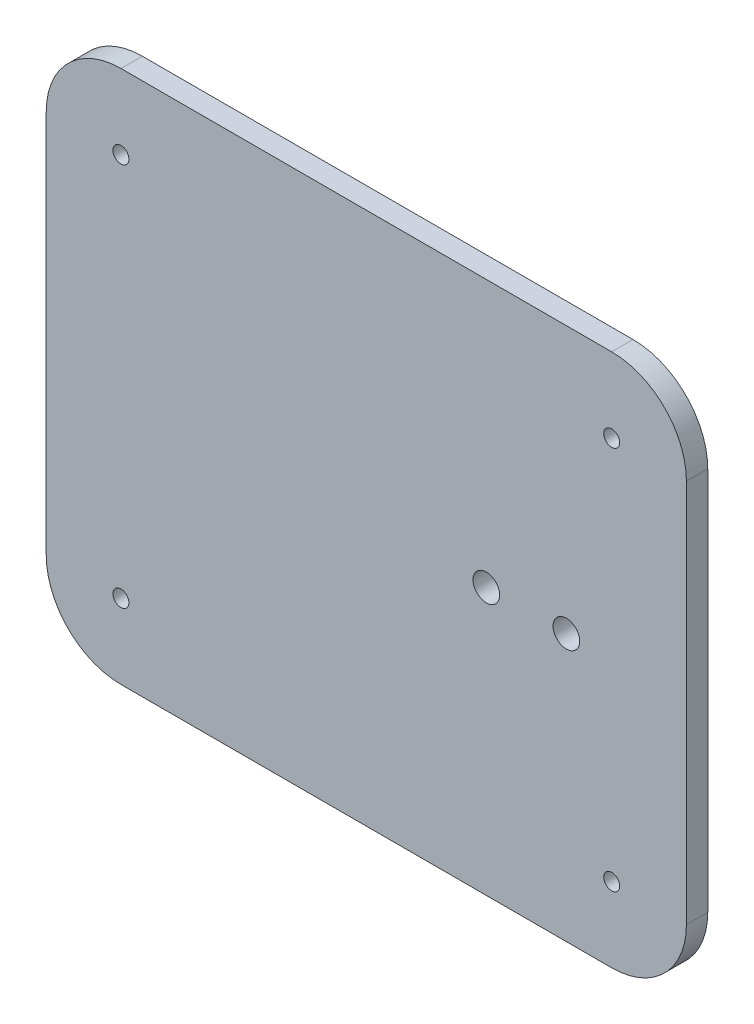
ISO-10303-21;
HEADER;
FILE_DESCRIPTION(('STEP AP214'),'2;1');
FILE_NAME('part.step','',(''),(''),'','','');
FILE_SCHEMA(('AUTOMOTIVE_DESIGN { 1 0 10303 214 1 1 1 1 }'));
ENDSEC;
DATA;
#1=APPLICATION_CONTEXT('core data for automotive mechanical design processes');
#2=APPLICATION_PROTOCOL_DEFINITION('international standard','automotive_design',2000,#1);
#3=PRODUCT_CONTEXT('',#1,'mechanical');
#4=PRODUCT('Part','Part','',(#3));
#5=PRODUCT_RELATED_PRODUCT_CATEGORY('part','',(#4));
#6=PRODUCT_DEFINITION_FORMATION('','',#4);
#7=PRODUCT_DEFINITION_CONTEXT('part definition',#1,'design');
#8=PRODUCT_DEFINITION('design','',#6,#7);
#9=PRODUCT_DEFINITION_SHAPE('','',#8);
#10=(LENGTH_UNIT() NAMED_UNIT(*) SI_UNIT(.MILLI.,.METRE.));
#11=(NAMED_UNIT(*) PLANE_ANGLE_UNIT() SI_UNIT($,.RADIAN.));
#12=(NAMED_UNIT(*) SI_UNIT($,.STERADIAN.) SOLID_ANGLE_UNIT());
#13=UNCERTAINTY_MEASURE_WITH_UNIT(LENGTH_MEASURE(1.E-05),#10,'distance_accuracy_value','');
#14=(GEOMETRIC_REPRESENTATION_CONTEXT(3) GLOBAL_UNCERTAINTY_ASSIGNED_CONTEXT((#13)) GLOBAL_UNIT_ASSIGNED_CONTEXT((#10,
#11,#12)) REPRESENTATION_CONTEXT('',''));
#15=CARTESIAN_POINT('',(0.,0.,0.));
#16=DIRECTION('',(0.,0.,1.));
#17=DIRECTION('',(1.,0.,0.));
#18=AXIS2_PLACEMENT_3D('',#15,#16,#17);
#19=CARTESIAN_POINT('',(-52.655601659751,38.8381742738589,4.));
#20=DIRECTION('',(1.,0.,0.));
#21=DIRECTION('',(0.,1.,0.));
#22=AXIS2_PLACEMENT_3D('',#19,#20,#21);
#23=PLANE('',#22);
#24=DIRECTION('',(0.,-1.,0.));
#25=VECTOR('',#24,1.);
#26=CARTESIAN_POINT('',(-52.655601659751,38.8381742738589,0.));
#27=LINE('',#26,#25);
#28=CARTESIAN_POINT('',(-52.655601659751,24.8381742738589,0.));
#29=VERTEX_POINT('',#28);
#30=CARTESIAN_POINT('',(-52.655601659751,-47.1618257261411,0.));
#31=VERTEX_POINT('',#30);
#32=EDGE_CURVE('E185',#29,#31,#27,.T.);
#33=ORIENTED_EDGE('',*,*,#32,.T.);
#34=DIRECTION('',(0.,0.,-1.));
#35=VECTOR('',#34,1.);
#36=CARTESIAN_POINT('',(-52.655601659751,-47.1618257261411,4.));
#37=LINE('',#36,#35);
#38=CARTESIAN_POINT('',(-52.655601659751,-47.1618257261411,4.));
#39=VERTEX_POINT('',#38);
#40=EDGE_CURVE('E11',#31,#39,#37,.F.);
#41=ORIENTED_EDGE('',*,*,#40,.T.);
#42=DIRECTION('',(0.,-1.,0.));
#43=VECTOR('',#42,1.);
#44=CARTESIAN_POINT('',(-52.655601659751,38.8381742738589,4.));
#45=LINE('',#44,#43);
#46=CARTESIAN_POINT('',(-52.655601659751,24.8381742738589,4.));
#47=VERTEX_POINT('',#46);
#48=EDGE_CURVE('E138',#47,#39,#45,.T.);
#49=ORIENTED_EDGE('',*,*,#48,.F.);
#50=DIRECTION('',(0.,0.,-1.));
#51=VECTOR('',#50,1.);
#52=CARTESIAN_POINT('',(-52.655601659751,24.8381742738589,4.));
#53=LINE('',#52,#51);
#54=EDGE_CURVE('E51',#47,#29,#53,.T.);
#55=ORIENTED_EDGE('',*,*,#54,.T.);
#56=EDGE_LOOP('',(#33,#41,#49,#55));
#57=FACE_BOUND('',#56,.T.);
#58=ADVANCED_FACE('F42',(#57),#23,.F.);
#59=CARTESIAN_POINT('',(-52.655601659751,-61.1618257261411,4.));
#60=DIRECTION('',(0.,1.,0.));
#61=DIRECTION('',(0.,0.,1.));
#62=AXIS2_PLACEMENT_3D('',#59,#60,#61);
#63=PLANE('',#62);
#64=DIRECTION('',(1.,0.,0.));
#65=VECTOR('',#64,1.);
#66=CARTESIAN_POINT('',(-52.655601659751,-61.1618257261411,0.));
#67=LINE('',#66,#65);
#68=CARTESIAN_POINT('',(-38.655601659751,-61.1618257261411,0.));
#69=VERTEX_POINT('',#68);
#70=CARTESIAN_POINT('',(53.3443983402489,-61.1618257261411,0.));
#71=VERTEX_POINT('',#70);
#72=EDGE_CURVE('E145',#69,#71,#67,.T.);
#73=ORIENTED_EDGE('',*,*,#72,.T.);
#74=DIRECTION('',(0.,0.,-1.));
#75=VECTOR('',#74,1.);
#76=CARTESIAN_POINT('',(53.344398340249,-61.1618257261411,4.));
#77=LINE('',#76,#75);
#78=CARTESIAN_POINT('',(53.3443983402489,-61.1618257261411,4.));
#79=VERTEX_POINT('',#78);
#80=EDGE_CURVE('E58',#71,#79,#77,.F.);
#81=ORIENTED_EDGE('',*,*,#80,.T.);
#82=DIRECTION('',(1.,0.,0.));
#83=VECTOR('',#82,1.);
#84=CARTESIAN_POINT('',(-52.655601659751,-61.1618257261411,4.));
#85=LINE('',#84,#83);
#86=CARTESIAN_POINT('',(-38.655601659751,-61.1618257261411,4.));
#87=VERTEX_POINT('',#86);
#88=EDGE_CURVE('E143',#87,#79,#85,.T.);
#89=ORIENTED_EDGE('',*,*,#88,.F.);
#90=DIRECTION('',(0.,0.,-1.));
#91=VECTOR('',#90,1.);
#92=CARTESIAN_POINT('',(-38.655601659751,-61.1618257261411,4.));
#93=LINE('',#92,#91);
#94=EDGE_CURVE('E174',#87,#69,#93,.T.);
#95=ORIENTED_EDGE('',*,*,#94,.T.);
#96=EDGE_LOOP('',(#73,#81,#89,#95));
#97=FACE_BOUND('',#96,.T.);
#98=ADVANCED_FACE('F290',(#97),#63,.F.);
#99=CARTESIAN_POINT('',(67.344398340249,38.8381742738589,4.));
#100=DIRECTION('',(-1.,0.,0.));
#101=DIRECTION('',(0.,0.,1.));
#102=AXIS2_PLACEMENT_3D('',#99,#100,#101);
#103=PLANE('',#102);
#104=DIRECTION('',(0.,1.,0.));
#105=VECTOR('',#104,1.);
#106=CARTESIAN_POINT('',(67.344398340249,38.8381742738589,0.));
#107=LINE('',#106,#105);
#108=CARTESIAN_POINT('',(67.344398340249,-47.1618257261411,0.));
#109=VERTEX_POINT('',#108);
#110=CARTESIAN_POINT('',(67.344398340249,24.8381742738589,0.));
#111=VERTEX_POINT('',#110);
#112=EDGE_CURVE('E139',#109,#111,#107,.T.);
#113=ORIENTED_EDGE('',*,*,#112,.T.);
#114=DIRECTION('',(0.,0.,-1.));
#115=VECTOR('',#114,1.);
#116=CARTESIAN_POINT('',(67.344398340249,24.8381742738589,4.));
#117=LINE('',#116,#115);
#118=CARTESIAN_POINT('',(67.344398340249,24.8381742738589,4.));
#119=VERTEX_POINT('',#118);
#120=EDGE_CURVE('E114',#111,#119,#117,.F.);
#121=ORIENTED_EDGE('',*,*,#120,.T.);
#122=DIRECTION('',(0.,1.,0.));
#123=VECTOR('',#122,1.);
#124=CARTESIAN_POINT('',(67.344398340249,38.8381742738589,4.));
#125=LINE('',#124,#123);
#126=CARTESIAN_POINT('',(67.344398340249,-47.1618257261411,4.));
#127=VERTEX_POINT('',#126);
#128=EDGE_CURVE('E201',#127,#119,#125,.T.);
#129=ORIENTED_EDGE('',*,*,#128,.F.);
#130=DIRECTION('',(0.,0.,-1.));
#131=VECTOR('',#130,1.);
#132=CARTESIAN_POINT('',(67.344398340249,-47.1618257261411,4.));
#133=LINE('',#132,#131);
#134=EDGE_CURVE('E120',#127,#109,#133,.T.);
#135=ORIENTED_EDGE('',*,*,#134,.T.);
#136=EDGE_LOOP('',(#113,#121,#129,#135));
#137=FACE_BOUND('',#136,.T.);
#138=ADVANCED_FACE('F287',(#137),#103,.F.);
#139=CARTESIAN_POINT('',(-52.655601659751,38.8381742738589,4.));
#140=DIRECTION('',(0.,-1.,0.));
#141=DIRECTION('',(0.,0.,-1.));
#142=AXIS2_PLACEMENT_3D('',#139,#140,#141);
#143=PLANE('',#142);
#144=DIRECTION('',(-1.,0.,0.));
#145=VECTOR('',#144,1.);
#146=CARTESIAN_POINT('',(-52.655601659751,38.8381742738589,4.));
#147=LINE('',#146,#145);
#148=CARTESIAN_POINT('',(53.344398340249,38.8381742738589,4.));
#149=VERTEX_POINT('',#148);
#150=CARTESIAN_POINT('',(-38.655601659751,38.8381742738589,4.));
#151=VERTEX_POINT('',#150);
#152=EDGE_CURVE('E130',#149,#151,#147,.T.);
#153=ORIENTED_EDGE('',*,*,#152,.F.);
#154=DIRECTION('',(0.,0.,-1.));
#155=VECTOR('',#154,1.);
#156=CARTESIAN_POINT('',(53.344398340249,38.8381742738589,4.));
#157=LINE('',#156,#155);
#158=CARTESIAN_POINT('',(53.344398340249,38.8381742738589,0.));
#159=VERTEX_POINT('',#158);
#160=EDGE_CURVE('E113',#149,#159,#157,.T.);
#161=ORIENTED_EDGE('',*,*,#160,.T.);
#162=DIRECTION('',(-1.,0.,0.));
#163=VECTOR('',#162,1.);
#164=CARTESIAN_POINT('',(-52.655601659751,38.8381742738589,0.));
#165=LINE('',#164,#163);
#166=CARTESIAN_POINT('',(-38.655601659751,38.8381742738589,0.));
#167=VERTEX_POINT('',#166);
#168=EDGE_CURVE('E127',#159,#167,#165,.T.);
#169=ORIENTED_EDGE('',*,*,#168,.T.);
#170=DIRECTION('',(0.,0.,-1.));
#171=VECTOR('',#170,1.);
#172=CARTESIAN_POINT('',(-38.655601659751,38.8381742738589,4.));
#173=LINE('',#172,#171);
#174=EDGE_CURVE('E133',#167,#151,#173,.F.);
#175=ORIENTED_EDGE('',*,*,#174,.T.);
#176=EDGE_LOOP('',(#153,#161,#169,#175));
#177=FACE_BOUND('',#176,.T.);
#178=ADVANCED_FACE('F126',(#177),#143,.F.);
#179=CARTESIAN_POINT('',(0.,0.,4.));
#180=DIRECTION('',(0.,0.,1.));
#181=DIRECTION('',(1.,0.,0.));
#182=AXIS2_PLACEMENT_3D('',#179,#180,#181);
#183=PLANE('',#182);
#184=CARTESIAN_POINT('',(44.844398340249,-11.1618257261411,4.));
#185=DIRECTION('',(0.,0.,-1.));
#186=DIRECTION('',(-1.,0.,0.));
#187=AXIS2_PLACEMENT_3D('',#184,#185,#186);
#188=CIRCLE('',#187,2.5);
#189=CARTESIAN_POINT('',(42.344398340249,-11.1618257261411,4.));
#190=VERTEX_POINT('',#189);
#191=EDGE_CURVE('E216',#190,#190,#188,.T.);
#192=ORIENTED_EDGE('',*,*,#191,.T.);
#193=EDGE_LOOP('',(#192));
#194=FACE_BOUND('',#193,.T.);
#195=CARTESIAN_POINT('',(29.844398340249,-11.1618257261411,4.));
#196=DIRECTION('',(0.,0.,-1.));
#197=DIRECTION('',(-1.,0.,0.));
#198=AXIS2_PLACEMENT_3D('',#195,#196,#197);
#199=CIRCLE('',#198,2.5);
#200=CARTESIAN_POINT('',(27.344398340249,-11.1618257261411,4.));
#201=VERTEX_POINT('',#200);
#202=EDGE_CURVE('E235',#201,#201,#199,.T.);
#203=ORIENTED_EDGE('',*,*,#202,.T.);
#204=EDGE_LOOP('',(#203));
#205=FACE_BOUND('',#204,.T.);
#206=CARTESIAN_POINT('',(53.3443983402491,-47.1618257261411,4.));
#207=DIRECTION('',(0.,0.,1.));
#208=DIRECTION('',(1.,0.,0.));
#209=AXIS2_PLACEMENT_3D('',#206,#207,#208);
#210=CIRCLE('',#209,1.5);
#211=CARTESIAN_POINT('',(54.8443983402491,-47.1618257261411,4.));
#212=VERTEX_POINT('',#211);
#213=EDGE_CURVE('E215',#212,#212,#210,.T.);
#214=ORIENTED_EDGE('',*,*,#213,.F.);
#215=EDGE_LOOP('',(#214));
#216=FACE_BOUND('',#215,.T.);
#217=CARTESIAN_POINT('',(-38.6556016597509,-47.1618257261411,4.));
#218=DIRECTION('',(0.,0.,1.));
#219=DIRECTION('',(1.,0.,0.));
#220=AXIS2_PLACEMENT_3D('',#217,#218,#219);
#221=CIRCLE('',#220,1.5);
#222=CARTESIAN_POINT('',(-37.1556016597509,-47.1618257261411,4.));
#223=VERTEX_POINT('',#222);
#224=EDGE_CURVE('E224',#223,#223,#221,.T.);
#225=ORIENTED_EDGE('',*,*,#224,.F.);
#226=EDGE_LOOP('',(#225));
#227=FACE_BOUND('',#226,.T.);
#228=CARTESIAN_POINT('',(-38.655601659751,24.8381742738589,4.));
#229=DIRECTION('',(0.,0.,1.));
#230=DIRECTION('',(1.,0.,0.));
#231=AXIS2_PLACEMENT_3D('',#228,#229,#230);
#232=CIRCLE('',#231,1.5);
#233=CARTESIAN_POINT('',(-37.155601659751,24.8381742738589,4.));
#234=VERTEX_POINT('',#233);
#235=EDGE_CURVE('E209',#234,#234,#232,.T.);
#236=ORIENTED_EDGE('',*,*,#235,.F.);
#237=EDGE_LOOP('',(#236));
#238=FACE_BOUND('',#237,.T.);
#239=CARTESIAN_POINT('',(53.3443983402489,24.8381742738589,4.));
#240=DIRECTION('',(0.,0.,1.));
#241=DIRECTION('',(1.,0.,0.));
#242=AXIS2_PLACEMENT_3D('',#239,#240,#241);
#243=CIRCLE('',#242,1.5);
#244=CARTESIAN_POINT('',(54.8443983402489,24.8381742738589,4.));
#245=VERTEX_POINT('',#244);
#246=EDGE_CURVE('E196',#245,#245,#243,.T.);
#247=ORIENTED_EDGE('',*,*,#246,.F.);
#248=EDGE_LOOP('',(#247));
#249=FACE_BOUND('',#248,.T.);
#250=ORIENTED_EDGE('',*,*,#128,.T.);
#251=CARTESIAN_POINT('',(53.344398340249,24.8381742738589,4.));
#252=DIRECTION('',(0.,0.,1.));
#253=DIRECTION('',(1.,0.,0.));
#254=AXIS2_PLACEMENT_3D('',#251,#252,#253);
#255=CIRCLE('',#254,14.);
#256=EDGE_CURVE('E171',#119,#149,#255,.T.);
#257=ORIENTED_EDGE('',*,*,#256,.T.);
#258=ORIENTED_EDGE('',*,*,#152,.T.);
#259=CARTESIAN_POINT('',(-38.655601659751,24.8381742738589,4.));
#260=DIRECTION('',(0.,0.,1.));
#261=DIRECTION('',(1.,0.,0.));
#262=AXIS2_PLACEMENT_3D('',#259,#260,#261);
#263=CIRCLE('',#262,14.);
#264=EDGE_CURVE('E163',#151,#47,#263,.T.);
#265=ORIENTED_EDGE('',*,*,#264,.T.);
#266=ORIENTED_EDGE('',*,*,#48,.T.);
#267=CARTESIAN_POINT('',(-38.655601659751,-47.1618257261411,4.));
#268=DIRECTION('',(0.,0.,1.));
#269=DIRECTION('',(1.,0.,0.));
#270=AXIS2_PLACEMENT_3D('',#267,#268,#269);
#271=CIRCLE('',#270,14.);
#272=EDGE_CURVE('E65',#39,#87,#271,.T.);
#273=ORIENTED_EDGE('',*,*,#272,.T.);
#274=ORIENTED_EDGE('',*,*,#88,.T.);
#275=CARTESIAN_POINT('',(53.344398340249,-47.1618257261411,4.));
#276=DIRECTION('',(0.,0.,1.));
#277=DIRECTION('',(1.,0.,0.));
#278=AXIS2_PLACEMENT_3D('',#275,#276,#277);
#279=CIRCLE('',#278,14.);
#280=EDGE_CURVE('E168',#79,#127,#279,.T.);
#281=ORIENTED_EDGE('',*,*,#280,.T.);
#282=EDGE_LOOP('',(#250,#257,#258,#265,#266,#273,#274,#281));
#283=FACE_BOUND('',#282,.T.);
#284=ADVANCED_FACE('F251',(#194,#205,#216,#227,#238,#249,#283),#183,.T.);
#285=CARTESIAN_POINT('',(0.,0.,0.));
#286=DIRECTION('',(0.,0.,1.));
#287=DIRECTION('',(1.,0.,0.));
#288=AXIS2_PLACEMENT_3D('',#285,#286,#287);
#289=PLANE('',#288);
#290=CARTESIAN_POINT('',(44.844398340249,-11.1618257261411,0.));
#291=DIRECTION('',(0.,0.,-1.));
#292=DIRECTION('',(-1.,0.,0.));
#293=AXIS2_PLACEMENT_3D('',#290,#291,#292);
#294=CIRCLE('',#293,2.5);
#295=CARTESIAN_POINT('',(42.344398340249,-11.1618257261411,0.));
#296=VERTEX_POINT('',#295);
#297=EDGE_CURVE('E243',#296,#296,#294,.T.);
#298=ORIENTED_EDGE('',*,*,#297,.F.);
#299=EDGE_LOOP('',(#298));
#300=FACE_BOUND('',#299,.T.);
#301=CARTESIAN_POINT('',(29.844398340249,-11.1618257261411,0.));
#302=DIRECTION('',(0.,0.,-1.));
#303=DIRECTION('',(-1.,0.,0.));
#304=AXIS2_PLACEMENT_3D('',#301,#302,#303);
#305=CIRCLE('',#304,2.5);
#306=CARTESIAN_POINT('',(27.344398340249,-11.1618257261411,0.));
#307=VERTEX_POINT('',#306);
#308=EDGE_CURVE('E239',#307,#307,#305,.T.);
#309=ORIENTED_EDGE('',*,*,#308,.F.);
#310=EDGE_LOOP('',(#309));
#311=FACE_BOUND('',#310,.T.);
#312=CARTESIAN_POINT('',(53.3443983402491,-47.1618257261411,0.));
#313=DIRECTION('',(0.,0.,1.));
#314=DIRECTION('',(1.,0.,0.));
#315=AXIS2_PLACEMENT_3D('',#312,#313,#314);
#316=CIRCLE('',#315,1.5);
#317=CARTESIAN_POINT('',(54.8443983402491,-47.1618257261411,0.));
#318=VERTEX_POINT('',#317);
#319=EDGE_CURVE('E211',#318,#318,#316,.T.);
#320=ORIENTED_EDGE('',*,*,#319,.T.);
#321=EDGE_LOOP('',(#320));
#322=FACE_BOUND('',#321,.T.);
#323=CARTESIAN_POINT('',(-38.6556016597509,-47.1618257261411,0.));
#324=DIRECTION('',(0.,0.,1.));
#325=DIRECTION('',(1.,0.,0.));
#326=AXIS2_PLACEMENT_3D('',#323,#324,#325);
#327=CIRCLE('',#326,1.5);
#328=CARTESIAN_POINT('',(-37.1556016597509,-47.1618257261411,0.));
#329=VERTEX_POINT('',#328);
#330=EDGE_CURVE('E220',#329,#329,#327,.T.);
#331=ORIENTED_EDGE('',*,*,#330,.T.);
#332=EDGE_LOOP('',(#331));
#333=FACE_BOUND('',#332,.T.);
#334=CARTESIAN_POINT('',(-38.655601659751,24.8381742738589,0.));
#335=DIRECTION('',(0.,0.,1.));
#336=DIRECTION('',(1.,0.,0.));
#337=AXIS2_PLACEMENT_3D('',#334,#335,#336);
#338=CIRCLE('',#337,1.5);
#339=CARTESIAN_POINT('',(-37.155601659751,24.8381742738589,0.));
#340=VERTEX_POINT('',#339);
#341=EDGE_CURVE('E228',#340,#340,#338,.T.);
#342=ORIENTED_EDGE('',*,*,#341,.T.);
#343=EDGE_LOOP('',(#342));
#344=FACE_BOUND('',#343,.T.);
#345=CARTESIAN_POINT('',(53.3443983402489,24.8381742738589,0.));
#346=DIRECTION('',(0.,0.,1.));
#347=DIRECTION('',(1.,0.,0.));
#348=AXIS2_PLACEMENT_3D('',#345,#346,#347);
#349=CIRCLE('',#348,1.5);
#350=CARTESIAN_POINT('',(54.8443983402489,24.8381742738589,0.));
#351=VERTEX_POINT('',#350);
#352=EDGE_CURVE('E191',#351,#351,#349,.T.);
#353=ORIENTED_EDGE('',*,*,#352,.T.);
#354=EDGE_LOOP('',(#353));
#355=FACE_BOUND('',#354,.T.);
#356=ORIENTED_EDGE('',*,*,#168,.F.);
#357=CARTESIAN_POINT('',(53.344398340249,24.8381742738589,0.));
#358=DIRECTION('',(0.,0.,1.));
#359=DIRECTION('',(1.,0.,0.));
#360=AXIS2_PLACEMENT_3D('',#357,#358,#359);
#361=CIRCLE('',#360,14.);
#362=EDGE_CURVE('E109',#159,#111,#361,.F.);
#363=ORIENTED_EDGE('',*,*,#362,.T.);
#364=ORIENTED_EDGE('',*,*,#112,.F.);
#365=CARTESIAN_POINT('',(53.344398340249,-47.1618257261411,0.));
#366=DIRECTION('',(0.,0.,1.));
#367=DIRECTION('',(1.,0.,0.));
#368=AXIS2_PLACEMENT_3D('',#365,#366,#367);
#369=CIRCLE('',#368,14.);
#370=EDGE_CURVE('E121',#109,#71,#369,.F.);
#371=ORIENTED_EDGE('',*,*,#370,.T.);
#372=ORIENTED_EDGE('',*,*,#72,.F.);
#373=CARTESIAN_POINT('',(-38.655601659751,-47.1618257261411,0.));
#374=DIRECTION('',(0.,0.,1.));
#375=DIRECTION('',(1.,0.,0.));
#376=AXIS2_PLACEMENT_3D('',#373,#374,#375);
#377=CIRCLE('',#376,14.);
#378=EDGE_CURVE('E153',#69,#31,#377,.F.);
#379=ORIENTED_EDGE('',*,*,#378,.T.);
#380=ORIENTED_EDGE('',*,*,#32,.F.);
#381=CARTESIAN_POINT('',(-38.655601659751,24.8381742738589,0.));
#382=DIRECTION('',(0.,0.,1.));
#383=DIRECTION('',(1.,0.,0.));
#384=AXIS2_PLACEMENT_3D('',#381,#382,#383);
#385=CIRCLE('',#384,14.);
#386=EDGE_CURVE('E132',#29,#167,#385,.F.);
#387=ORIENTED_EDGE('',*,*,#386,.T.);
#388=EDGE_LOOP('',(#356,#363,#364,#371,#372,#379,#380,#387));
#389=FACE_BOUND('',#388,.T.);
#390=ADVANCED_FACE('F135',(#300,#311,#322,#333,#344,#355,#389),#289,.F.);
#391=CARTESIAN_POINT('',(53.344398340249,24.8381742738589,4.));
#392=DIRECTION('',(0.,0.,-1.));
#393=DIRECTION('',(-1.,0.,0.));
#394=AXIS2_PLACEMENT_3D('',#391,#392,#393);
#395=CYLINDRICAL_SURFACE('',#394,14.);
#396=ORIENTED_EDGE('',*,*,#256,.F.);
#397=ORIENTED_EDGE('',*,*,#120,.F.);
#398=ORIENTED_EDGE('',*,*,#362,.F.);
#399=ORIENTED_EDGE('',*,*,#160,.F.);
#400=EDGE_LOOP('',(#396,#397,#398,#399));
#401=FACE_BOUND('',#400,.T.);
#402=ADVANCED_FACE('F112',(#401),#395,.T.);
#403=CARTESIAN_POINT('',(53.344398340249,-47.1618257261411,4.));
#404=DIRECTION('',(0.,0.,-1.));
#405=DIRECTION('',(-1.,0.,0.));
#406=AXIS2_PLACEMENT_3D('',#403,#404,#405);
#407=CYLINDRICAL_SURFACE('',#406,14.);
#408=ORIENTED_EDGE('',*,*,#280,.F.);
#409=ORIENTED_EDGE('',*,*,#80,.F.);
#410=ORIENTED_EDGE('',*,*,#370,.F.);
#411=ORIENTED_EDGE('',*,*,#134,.F.);
#412=EDGE_LOOP('',(#408,#409,#410,#411));
#413=FACE_BOUND('',#412,.T.);
#414=ADVANCED_FACE('F289',(#413),#407,.T.);
#415=CARTESIAN_POINT('',(-38.655601659751,-47.1618257261411,4.));
#416=DIRECTION('',(0.,0.,-1.));
#417=DIRECTION('',(-1.,0.,0.));
#418=AXIS2_PLACEMENT_3D('',#415,#416,#417);
#419=CYLINDRICAL_SURFACE('',#418,14.);
#420=ORIENTED_EDGE('',*,*,#272,.F.);
#421=ORIENTED_EDGE('',*,*,#40,.F.);
#422=ORIENTED_EDGE('',*,*,#378,.F.);
#423=ORIENTED_EDGE('',*,*,#94,.F.);
#424=EDGE_LOOP('',(#420,#421,#422,#423));
#425=FACE_BOUND('',#424,.T.);
#426=ADVANCED_FACE('F293',(#425),#419,.T.);
#427=CARTESIAN_POINT('',(-38.655601659751,24.8381742738589,4.));
#428=DIRECTION('',(0.,0.,-1.));
#429=DIRECTION('',(-1.,0.,0.));
#430=AXIS2_PLACEMENT_3D('',#427,#428,#429);
#431=CYLINDRICAL_SURFACE('',#430,14.);
#432=ORIENTED_EDGE('',*,*,#264,.F.);
#433=ORIENTED_EDGE('',*,*,#174,.F.);
#434=ORIENTED_EDGE('',*,*,#386,.F.);
#435=ORIENTED_EDGE('',*,*,#54,.F.);
#436=EDGE_LOOP('',(#432,#433,#434,#435));
#437=FACE_BOUND('',#436,.T.);
#438=ADVANCED_FACE('F44',(#437),#431,.T.);
#439=CARTESIAN_POINT('',(53.3443983402489,24.8381742738589,0.));
#440=DIRECTION('',(0.,0.,1.));
#441=DIRECTION('',(1.,0.,0.));
#442=AXIS2_PLACEMENT_3D('',#439,#440,#441);
#443=CYLINDRICAL_SURFACE('',#442,1.5);
#444=ORIENTED_EDGE('',*,*,#352,.F.);
#445=EDGE_LOOP('',(#444));
#446=FACE_BOUND('',#445,.T.);
#447=ORIENTED_EDGE('',*,*,#246,.T.);
#448=EDGE_LOOP('',(#447));
#449=FACE_BOUND('',#448,.T.);
#450=ADVANCED_FACE('F274',(#446,#449),#443,.F.);
#451=CARTESIAN_POINT('',(-38.655601659751,24.8381742738589,0.));
#452=DIRECTION('',(0.,0.,1.));
#453=DIRECTION('',(1.,0.,0.));
#454=AXIS2_PLACEMENT_3D('',#451,#452,#453);
#455=CYLINDRICAL_SURFACE('',#454,1.5);
#456=ORIENTED_EDGE('',*,*,#341,.F.);
#457=EDGE_LOOP('',(#456));
#458=FACE_BOUND('',#457,.T.);
#459=ORIENTED_EDGE('',*,*,#235,.T.);
#460=EDGE_LOOP('',(#459));
#461=FACE_BOUND('',#460,.T.);
#462=ADVANCED_FACE('F277',(#458,#461),#455,.F.);
#463=CARTESIAN_POINT('',(-38.6556016597509,-47.1618257261411,0.));
#464=DIRECTION('',(0.,0.,1.));
#465=DIRECTION('',(1.,0.,0.));
#466=AXIS2_PLACEMENT_3D('',#463,#464,#465);
#467=CYLINDRICAL_SURFACE('',#466,1.5);
#468=ORIENTED_EDGE('',*,*,#330,.F.);
#469=EDGE_LOOP('',(#468));
#470=FACE_BOUND('',#469,.T.);
#471=ORIENTED_EDGE('',*,*,#224,.T.);
#472=EDGE_LOOP('',(#471));
#473=FACE_BOUND('',#472,.T.);
#474=ADVANCED_FACE('F339',(#470,#473),#467,.F.);
#475=CARTESIAN_POINT('',(53.3443983402491,-47.1618257261411,0.));
#476=DIRECTION('',(0.,0.,1.));
#477=DIRECTION('',(1.,0.,0.));
#478=AXIS2_PLACEMENT_3D('',#475,#476,#477);
#479=CYLINDRICAL_SURFACE('',#478,1.5);
#480=ORIENTED_EDGE('',*,*,#319,.F.);
#481=EDGE_LOOP('',(#480));
#482=FACE_BOUND('',#481,.T.);
#483=ORIENTED_EDGE('',*,*,#213,.T.);
#484=EDGE_LOOP('',(#483));
#485=FACE_BOUND('',#484,.T.);
#486=ADVANCED_FACE('F350',(#482,#485),#479,.F.);
#487=CARTESIAN_POINT('',(29.844398340249,-11.1618257261411,4.));
#488=DIRECTION('',(0.,0.,-1.));
#489=DIRECTION('',(-1.,0.,0.));
#490=AXIS2_PLACEMENT_3D('',#487,#488,#489);
#491=CYLINDRICAL_SURFACE('',#490,2.5);
#492=ORIENTED_EDGE('',*,*,#202,.F.);
#493=EDGE_LOOP('',(#492));
#494=FACE_BOUND('',#493,.T.);
#495=ORIENTED_EDGE('',*,*,#308,.T.);
#496=EDGE_LOOP('',(#495));
#497=FACE_BOUND('',#496,.T.);
#498=ADVANCED_FACE('F257',(#494,#497),#491,.F.);
#499=CARTESIAN_POINT('',(44.844398340249,-11.1618257261411,4.));
#500=DIRECTION('',(0.,0.,-1.));
#501=DIRECTION('',(-1.,0.,0.));
#502=AXIS2_PLACEMENT_3D('',#499,#500,#501);
#503=CYLINDRICAL_SURFACE('',#502,2.5);
#504=ORIENTED_EDGE('',*,*,#191,.F.);
#505=EDGE_LOOP('',(#504));
#506=FACE_BOUND('',#505,.T.);
#507=ORIENTED_EDGE('',*,*,#297,.T.);
#508=EDGE_LOOP('',(#507));
#509=FACE_BOUND('',#508,.T.);
#510=ADVANCED_FACE('F254',(#506,#509),#503,.F.);
#511=CLOSED_SHELL('',(#58,#98,#138,#178,#284,#390,#402,#414,#426,#438,#450,#462,#474,#486,#498,#510));
#512=MANIFOLD_SOLID_BREP('B2',#511);
#513=ADVANCED_BREP_SHAPE_REPRESENTATION('',(#18,#512),#14);
#514=SHAPE_DEFINITION_REPRESENTATION(#9,#513);
ENDSEC;
END-ISO-10303-21;
